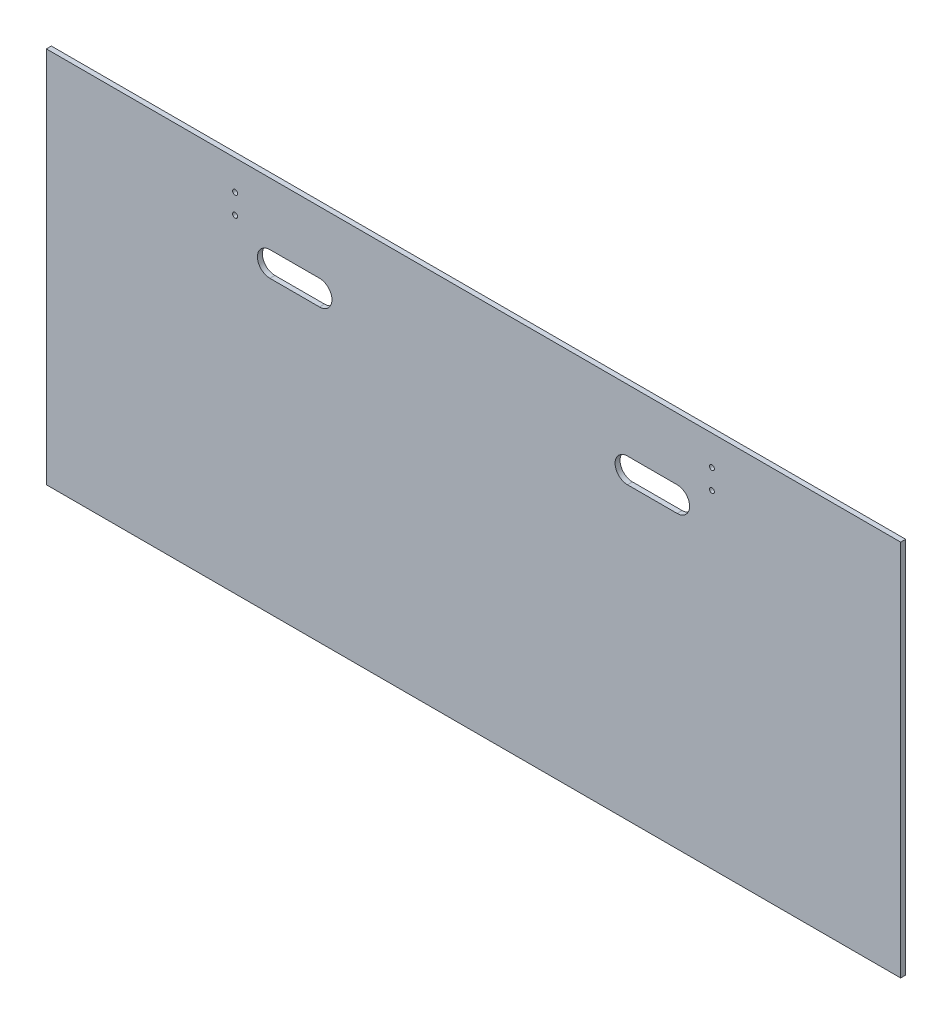
ISO-10303-21;
HEADER;
FILE_DESCRIPTION(('STEP AP214'),'2;1');
FILE_NAME('part.step','',(''),(''),'','','');
FILE_SCHEMA(('AUTOMOTIVE_DESIGN { 1 0 10303 214 1 1 1 1 }'));
ENDSEC;
DATA;
#1=APPLICATION_CONTEXT('core data for automotive mechanical design processes');
#2=APPLICATION_PROTOCOL_DEFINITION('international standard','automotive_design',2000,#1);
#3=PRODUCT_CONTEXT('',#1,'mechanical');
#4=PRODUCT('Part','Part','',(#3));
#5=PRODUCT_RELATED_PRODUCT_CATEGORY('part','',(#4));
#6=PRODUCT_DEFINITION_FORMATION('','',#4);
#7=PRODUCT_DEFINITION_CONTEXT('part definition',#1,'design');
#8=PRODUCT_DEFINITION('design','',#6,#7);
#9=PRODUCT_DEFINITION_SHAPE('','',#8);
#10=(LENGTH_UNIT() NAMED_UNIT(*) SI_UNIT(.MILLI.,.METRE.));
#11=(NAMED_UNIT(*) PLANE_ANGLE_UNIT() SI_UNIT($,.RADIAN.));
#12=(NAMED_UNIT(*) SI_UNIT($,.STERADIAN.) SOLID_ANGLE_UNIT());
#13=UNCERTAINTY_MEASURE_WITH_UNIT(LENGTH_MEASURE(1.E-05),#10,'distance_accuracy_value','');
#14=(GEOMETRIC_REPRESENTATION_CONTEXT(3) GLOBAL_UNCERTAINTY_ASSIGNED_CONTEXT((#13)) GLOBAL_UNIT_ASSIGNED_CONTEXT((#10,
#11,#12)) REPRESENTATION_CONTEXT('',''));
#15=CARTESIAN_POINT('',(0.,0.,0.));
#16=DIRECTION('',(0.,0.,1.));
#17=DIRECTION('',(1.,0.,0.));
#18=AXIS2_PLACEMENT_3D('',#15,#16,#17);
#19=CARTESIAN_POINT('',(0.,0.,6.35));
#20=DIRECTION('',(0.,0.,1.));
#21=DIRECTION('',(1.,0.,0.));
#22=AXIS2_PLACEMENT_3D('',#19,#20,#21);
#23=PLANE('',#22);
#24=DIRECTION('',(1.,0.,0.));
#25=VECTOR('',#24,1.);
#26=CARTESIAN_POINT('',(742.95,371.475,6.35));
#27=LINE('',#26,#25);
#28=CARTESIAN_POINT('',(806.45,371.475,6.35));
#29=VERTEX_POINT('',#28);
#30=CARTESIAN_POINT('',(742.95,371.475,6.35));
#31=VERTEX_POINT('',#30);
#32=EDGE_CURVE('E188',#29,#31,#27,.F.);
#33=ORIENTED_EDGE('',*,*,#32,.T.);
#34=CARTESIAN_POINT('',(742.95,387.35,6.35));
#35=DIRECTION('',(0.,0.,1.));
#36=DIRECTION('',(1.,0.,0.));
#37=AXIS2_PLACEMENT_3D('',#34,#35,#36);
#38=CIRCLE('',#37,15.875);
#39=CARTESIAN_POINT('',(742.95,403.225,6.35));
#40=VERTEX_POINT('',#39);
#41=EDGE_CURVE('E101',#31,#40,#38,.F.);
#42=ORIENTED_EDGE('',*,*,#41,.T.);
#43=DIRECTION('',(1.,0.,0.));
#44=VECTOR('',#43,1.);
#45=CARTESIAN_POINT('',(806.45,403.225,6.35));
#46=LINE('',#45,#44);
#47=CARTESIAN_POINT('',(806.45,403.225,6.35));
#48=VERTEX_POINT('',#47);
#49=EDGE_CURVE('E111',#40,#48,#46,.T.);
#50=ORIENTED_EDGE('',*,*,#49,.T.);
#51=CARTESIAN_POINT('',(806.45,387.35,6.35));
#52=DIRECTION('',(0.,0.,1.));
#53=DIRECTION('',(1.,0.,0.));
#54=AXIS2_PLACEMENT_3D('',#51,#52,#53);
#55=CIRCLE('',#54,15.875);
#56=EDGE_CURVE('E141',#48,#29,#55,.F.);
#57=ORIENTED_EDGE('',*,*,#56,.T.);
#58=EDGE_LOOP('',(#33,#42,#50,#57));
#59=FACE_BOUND('',#58,.T.);
#60=DIRECTION('',(1.,0.,0.));
#61=VECTOR('',#60,1.);
#62=CARTESIAN_POINT('',(285.75,371.475,6.35));
#63=LINE('',#62,#61);
#64=CARTESIAN_POINT('',(349.25,371.475,6.35));
#65=VERTEX_POINT('',#64);
#66=CARTESIAN_POINT('',(285.75,371.475,6.35));
#67=VERTEX_POINT('',#66);
#68=EDGE_CURVE('E97',#65,#67,#63,.F.);
#69=ORIENTED_EDGE('',*,*,#68,.T.);
#70=CARTESIAN_POINT('',(285.75,387.35,6.35));
#71=DIRECTION('',(0.,0.,1.));
#72=DIRECTION('',(1.,0.,0.));
#73=AXIS2_PLACEMENT_3D('',#70,#71,#72);
#74=CIRCLE('',#73,15.875);
#75=CARTESIAN_POINT('',(285.75,403.225,6.35));
#76=VERTEX_POINT('',#75);
#77=EDGE_CURVE('E82',#67,#76,#74,.F.);
#78=ORIENTED_EDGE('',*,*,#77,.T.);
#79=DIRECTION('',(1.,0.,0.));
#80=VECTOR('',#79,1.);
#81=CARTESIAN_POINT('',(349.25,403.225,6.35));
#82=LINE('',#81,#80);
#83=CARTESIAN_POINT('',(349.25,403.225,6.35));
#84=VERTEX_POINT('',#83);
#85=EDGE_CURVE('E113',#76,#84,#82,.T.);
#86=ORIENTED_EDGE('',*,*,#85,.T.);
#87=CARTESIAN_POINT('',(349.25,387.35,6.35));
#88=DIRECTION('',(0.,0.,1.));
#89=DIRECTION('',(1.,0.,0.));
#90=AXIS2_PLACEMENT_3D('',#87,#88,#89);
#91=CIRCLE('',#90,15.875);
#92=EDGE_CURVE('E105',#84,#65,#91,.F.);
#93=ORIENTED_EDGE('',*,*,#92,.T.);
#94=EDGE_LOOP('',(#69,#78,#86,#93));
#95=FACE_BOUND('',#94,.T.);
#96=CARTESIAN_POINT('',(850.9,419.1,6.35));
#97=DIRECTION('',(0.,0.,1.));
#98=DIRECTION('',(1.,0.,0.));
#99=AXIS2_PLACEMENT_3D('',#96,#97,#98);
#100=CIRCLE('',#99,3.175);
#101=CARTESIAN_POINT('',(854.075,419.1,6.35));
#102=VERTEX_POINT('',#101);
#103=EDGE_CURVE('E92',#102,#102,#100,.F.);
#104=ORIENTED_EDGE('',*,*,#103,.T.);
#105=EDGE_LOOP('',(#104));
#106=FACE_BOUND('',#105,.T.);
#107=CARTESIAN_POINT('',(850.9,444.5,6.35));
#108=DIRECTION('',(0.,0.,1.));
#109=DIRECTION('',(1.,0.,0.));
#110=AXIS2_PLACEMENT_3D('',#107,#108,#109);
#111=CIRCLE('',#110,3.175);
#112=CARTESIAN_POINT('',(854.075,444.5,6.35));
#113=VERTEX_POINT('',#112);
#114=EDGE_CURVE('E149',#113,#113,#111,.F.);
#115=ORIENTED_EDGE('',*,*,#114,.T.);
#116=EDGE_LOOP('',(#115));
#117=FACE_BOUND('',#116,.T.);
#118=CARTESIAN_POINT('',(241.3,419.1,6.35));
#119=DIRECTION('',(0.,0.,1.));
#120=DIRECTION('',(1.,0.,0.));
#121=AXIS2_PLACEMENT_3D('',#118,#119,#120);
#122=CIRCLE('',#121,3.175);
#123=CARTESIAN_POINT('',(244.475,419.1,6.35));
#124=VERTEX_POINT('',#123);
#125=EDGE_CURVE('E151',#124,#124,#122,.F.);
#126=ORIENTED_EDGE('',*,*,#125,.T.);
#127=EDGE_LOOP('',(#126));
#128=FACE_BOUND('',#127,.T.);
#129=CARTESIAN_POINT('',(241.3,444.5,6.35));
#130=DIRECTION('',(0.,0.,1.));
#131=DIRECTION('',(1.,0.,0.));
#132=AXIS2_PLACEMENT_3D('',#129,#130,#131);
#133=CIRCLE('',#132,3.175);
#134=CARTESIAN_POINT('',(244.475,444.5,6.35));
#135=VERTEX_POINT('',#134);
#136=EDGE_CURVE('E19',#135,#135,#133,.F.);
#137=ORIENTED_EDGE('',*,*,#136,.T.);
#138=EDGE_LOOP('',(#137));
#139=FACE_BOUND('',#138,.T.);
#140=DIRECTION('',(0.,1.,0.));
#141=VECTOR('',#140,1.);
#142=CARTESIAN_POINT('',(0.,482.6,6.35));
#143=LINE('',#142,#141);
#144=CARTESIAN_POINT('',(0.,0.,6.35));
#145=VERTEX_POINT('',#144);
#146=CARTESIAN_POINT('',(0.,482.6,6.35));
#147=VERTEX_POINT('',#146);
#148=EDGE_CURVE('E160',#145,#147,#143,.T.);
#149=ORIENTED_EDGE('',*,*,#148,.F.);
#150=DIRECTION('',(1.,0.,0.));
#151=VECTOR('',#150,1.);
#152=CARTESIAN_POINT('',(0.,0.,6.35));
#153=LINE('',#152,#151);
#154=CARTESIAN_POINT('',(1092.2,0.,6.35));
#155=VERTEX_POINT('',#154);
#156=EDGE_CURVE('E186',#155,#145,#153,.F.);
#157=ORIENTED_EDGE('',*,*,#156,.F.);
#158=DIRECTION('',(0.,1.,0.));
#159=VECTOR('',#158,1.);
#160=CARTESIAN_POINT('',(1092.2,0.,6.35));
#161=LINE('',#160,#159);
#162=CARTESIAN_POINT('',(1092.2,482.6,6.35));
#163=VERTEX_POINT('',#162);
#164=EDGE_CURVE('E183',#163,#155,#161,.F.);
#165=ORIENTED_EDGE('',*,*,#164,.F.);
#166=DIRECTION('',(1.,0.,0.));
#167=VECTOR('',#166,1.);
#168=CARTESIAN_POINT('',(1092.2,482.6,6.35));
#169=LINE('',#168,#167);
#170=EDGE_CURVE('E177',#147,#163,#169,.T.);
#171=ORIENTED_EDGE('',*,*,#170,.F.);
#172=EDGE_LOOP('',(#149,#157,#165,#171));
#173=FACE_BOUND('',#172,.T.);
#174=ADVANCED_FACE('F16',(#59,#95,#106,#117,#128,#139,#173),#23,.T.);
#175=CARTESIAN_POINT('',(0.,0.,0.));
#176=DIRECTION('',(0.,-1.,0.));
#177=DIRECTION('',(0.,0.,-1.));
#178=AXIS2_PLACEMENT_3D('',#175,#176,#177);
#179=PLANE('',#178);
#180=DIRECTION('',(0.,0.,1.));
#181=VECTOR('',#180,1.);
#182=CARTESIAN_POINT('',(0.,0.,0.));
#183=LINE('',#182,#181);
#184=CARTESIAN_POINT('',(0.,0.,0.));
#185=VERTEX_POINT('',#184);
#186=EDGE_CURVE('E167',#185,#145,#183,.T.);
#187=ORIENTED_EDGE('',*,*,#186,.F.);
#188=DIRECTION('',(1.,0.,0.));
#189=VECTOR('',#188,1.);
#190=CARTESIAN_POINT('',(0.,0.,0.));
#191=LINE('',#190,#189);
#192=CARTESIAN_POINT('',(1092.2,0.,0.));
#193=VERTEX_POINT('',#192);
#194=EDGE_CURVE('E193',#185,#193,#191,.T.);
#195=ORIENTED_EDGE('',*,*,#194,.T.);
#196=DIRECTION('',(0.,0.,-1.));
#197=VECTOR('',#196,1.);
#198=CARTESIAN_POINT('',(1092.2,0.,0.));
#199=LINE('',#198,#197);
#200=EDGE_CURVE('E180',#155,#193,#199,.T.);
#201=ORIENTED_EDGE('',*,*,#200,.F.);
#202=ORIENTED_EDGE('',*,*,#156,.T.);
#203=EDGE_LOOP('',(#187,#195,#201,#202));
#204=FACE_BOUND('',#203,.T.);
#205=ADVANCED_FACE('F234',(#204),#179,.T.);
#206=CARTESIAN_POINT('',(1092.2,0.,0.));
#207=DIRECTION('',(1.,0.,0.));
#208=DIRECTION('',(0.,0.,-1.));
#209=AXIS2_PLACEMENT_3D('',#206,#207,#208);
#210=PLANE('',#209);
#211=ORIENTED_EDGE('',*,*,#200,.T.);
#212=DIRECTION('',(0.,1.,0.));
#213=VECTOR('',#212,1.);
#214=CARTESIAN_POINT('',(1092.2,0.,0.));
#215=LINE('',#214,#213);
#216=CARTESIAN_POINT('',(1092.2,482.6,0.));
#217=VERTEX_POINT('',#216);
#218=EDGE_CURVE('E222',#193,#217,#215,.T.);
#219=ORIENTED_EDGE('',*,*,#218,.T.);
#220=DIRECTION('',(0.,0.,1.));
#221=VECTOR('',#220,1.);
#222=CARTESIAN_POINT('',(1092.2,482.6,0.));
#223=LINE('',#222,#221);
#224=EDGE_CURVE('E174',#163,#217,#223,.F.);
#225=ORIENTED_EDGE('',*,*,#224,.F.);
#226=ORIENTED_EDGE('',*,*,#164,.T.);
#227=EDGE_LOOP('',(#211,#219,#225,#226));
#228=FACE_BOUND('',#227,.T.);
#229=ADVANCED_FACE('F250',(#228),#210,.T.);
#230=CARTESIAN_POINT('',(1092.2,482.6,0.));
#231=DIRECTION('',(0.,1.,0.));
#232=DIRECTION('',(0.,0.,1.));
#233=AXIS2_PLACEMENT_3D('',#230,#231,#232);
#234=PLANE('',#233);
#235=ORIENTED_EDGE('',*,*,#224,.T.);
#236=DIRECTION('',(1.,0.,0.));
#237=VECTOR('',#236,1.);
#238=CARTESIAN_POINT('',(0.,482.6,0.));
#239=LINE('',#238,#237);
#240=CARTESIAN_POINT('',(0.,482.6,0.));
#241=VERTEX_POINT('',#240);
#242=EDGE_CURVE('E220',#217,#241,#239,.F.);
#243=ORIENTED_EDGE('',*,*,#242,.T.);
#244=DIRECTION('',(0.,0.,1.));
#245=VECTOR('',#244,1.);
#246=CARTESIAN_POINT('',(0.,482.6,0.));
#247=LINE('',#246,#245);
#248=EDGE_CURVE('E156',#147,#241,#247,.F.);
#249=ORIENTED_EDGE('',*,*,#248,.F.);
#250=ORIENTED_EDGE('',*,*,#170,.T.);
#251=EDGE_LOOP('',(#235,#243,#249,#250));
#252=FACE_BOUND('',#251,.T.);
#253=ADVANCED_FACE('F256',(#252),#234,.T.);
#254=CARTESIAN_POINT('',(0.,482.6,0.));
#255=DIRECTION('',(-1.,0.,0.));
#256=DIRECTION('',(0.,0.,1.));
#257=AXIS2_PLACEMENT_3D('',#254,#255,#256);
#258=PLANE('',#257);
#259=ORIENTED_EDGE('',*,*,#248,.T.);
#260=DIRECTION('',(0.,1.,0.));
#261=VECTOR('',#260,1.);
#262=CARTESIAN_POINT('',(0.,0.,0.));
#263=LINE('',#262,#261);
#264=EDGE_CURVE('E140',#241,#185,#263,.F.);
#265=ORIENTED_EDGE('',*,*,#264,.T.);
#266=ORIENTED_EDGE('',*,*,#186,.T.);
#267=ORIENTED_EDGE('',*,*,#148,.T.);
#268=EDGE_LOOP('',(#259,#265,#266,#267));
#269=FACE_BOUND('',#268,.T.);
#270=ADVANCED_FACE('F254',(#269),#258,.T.);
#271=CARTESIAN_POINT('',(241.3,444.5,0.));
#272=DIRECTION('',(0.,0.,1.));
#273=DIRECTION('',(1.,0.,0.));
#274=AXIS2_PLACEMENT_3D('',#271,#272,#273);
#275=CYLINDRICAL_SURFACE('',#274,3.175);
#276=ORIENTED_EDGE('',*,*,#136,.F.);
#277=EDGE_LOOP('',(#276));
#278=FACE_BOUND('',#277,.T.);
#279=CARTESIAN_POINT('',(241.3,444.5,0.));
#280=DIRECTION('',(0.,0.,1.));
#281=DIRECTION('',(1.,0.,0.));
#282=AXIS2_PLACEMENT_3D('',#279,#280,#281);
#283=CIRCLE('',#282,3.175);
#284=CARTESIAN_POINT('',(244.475,444.5,0.));
#285=VERTEX_POINT('',#284);
#286=EDGE_CURVE('E137',#285,#285,#283,.F.);
#287=ORIENTED_EDGE('',*,*,#286,.T.);
#288=EDGE_LOOP('',(#287));
#289=FACE_BOUND('',#288,.T.);
#290=ADVANCED_FACE('F264',(#278,#289),#275,.F.);
#291=CARTESIAN_POINT('',(241.3,419.1,0.));
#292=DIRECTION('',(0.,0.,1.));
#293=DIRECTION('',(1.,0.,0.));
#294=AXIS2_PLACEMENT_3D('',#291,#292,#293);
#295=CYLINDRICAL_SURFACE('',#294,3.175);
#296=ORIENTED_EDGE('',*,*,#125,.F.);
#297=EDGE_LOOP('',(#296));
#298=FACE_BOUND('',#297,.T.);
#299=CARTESIAN_POINT('',(241.3,419.1,0.));
#300=DIRECTION('',(0.,0.,1.));
#301=DIRECTION('',(1.,0.,0.));
#302=AXIS2_PLACEMENT_3D('',#299,#300,#301);
#303=CIRCLE('',#302,3.175);
#304=CARTESIAN_POINT('',(244.475,419.1,0.));
#305=VERTEX_POINT('',#304);
#306=EDGE_CURVE('E134',#305,#305,#303,.F.);
#307=ORIENTED_EDGE('',*,*,#306,.T.);
#308=EDGE_LOOP('',(#307));
#309=FACE_BOUND('',#308,.T.);
#310=ADVANCED_FACE('F303',(#298,#309),#295,.F.);
#311=CARTESIAN_POINT('',(850.9,444.5,0.));
#312=DIRECTION('',(0.,0.,1.));
#313=DIRECTION('',(1.,0.,0.));
#314=AXIS2_PLACEMENT_3D('',#311,#312,#313);
#315=CYLINDRICAL_SURFACE('',#314,3.175);
#316=ORIENTED_EDGE('',*,*,#114,.F.);
#317=EDGE_LOOP('',(#316));
#318=FACE_BOUND('',#317,.T.);
#319=CARTESIAN_POINT('',(850.9,444.5,0.));
#320=DIRECTION('',(0.,0.,1.));
#321=DIRECTION('',(1.,0.,0.));
#322=AXIS2_PLACEMENT_3D('',#319,#320,#321);
#323=CIRCLE('',#322,3.175);
#324=CARTESIAN_POINT('',(854.075,444.5,0.));
#325=VERTEX_POINT('',#324);
#326=EDGE_CURVE('E131',#325,#325,#323,.F.);
#327=ORIENTED_EDGE('',*,*,#326,.T.);
#328=EDGE_LOOP('',(#327));
#329=FACE_BOUND('',#328,.T.);
#330=ADVANCED_FACE('F299',(#318,#329),#315,.F.);
#331=CARTESIAN_POINT('',(850.9,419.1,0.));
#332=DIRECTION('',(0.,0.,1.));
#333=DIRECTION('',(1.,0.,0.));
#334=AXIS2_PLACEMENT_3D('',#331,#332,#333);
#335=CYLINDRICAL_SURFACE('',#334,3.175);
#336=ORIENTED_EDGE('',*,*,#103,.F.);
#337=EDGE_LOOP('',(#336));
#338=FACE_BOUND('',#337,.T.);
#339=CARTESIAN_POINT('',(850.9,419.1,0.));
#340=DIRECTION('',(0.,0.,1.));
#341=DIRECTION('',(1.,0.,0.));
#342=AXIS2_PLACEMENT_3D('',#339,#340,#341);
#343=CIRCLE('',#342,3.175);
#344=CARTESIAN_POINT('',(854.075,419.1,0.));
#345=VERTEX_POINT('',#344);
#346=EDGE_CURVE('E128',#345,#345,#343,.F.);
#347=ORIENTED_EDGE('',*,*,#346,.T.);
#348=EDGE_LOOP('',(#347));
#349=FACE_BOUND('',#348,.T.);
#350=ADVANCED_FACE('F296',(#338,#349),#335,.F.);
#351=CARTESIAN_POINT('',(285.75,387.35,0.));
#352=DIRECTION('',(0.,0.,1.));
#353=DIRECTION('',(1.,0.,0.));
#354=AXIS2_PLACEMENT_3D('',#351,#352,#353);
#355=CYLINDRICAL_SURFACE('',#354,15.875);
#356=ORIENTED_EDGE('',*,*,#77,.F.);
#357=DIRECTION('',(0.,0.,-1.));
#358=VECTOR('',#357,1.);
#359=CARTESIAN_POINT('',(285.75,371.475,0.));
#360=LINE('',#359,#358);
#361=CARTESIAN_POINT('',(285.75,371.475,0.));
#362=VERTEX_POINT('',#361);
#363=EDGE_CURVE('E86',#67,#362,#360,.T.);
#364=ORIENTED_EDGE('',*,*,#363,.T.);
#365=CARTESIAN_POINT('',(285.75,387.35,0.));
#366=DIRECTION('',(0.,0.,1.));
#367=DIRECTION('',(1.,0.,0.));
#368=AXIS2_PLACEMENT_3D('',#365,#366,#367);
#369=CIRCLE('',#368,15.875);
#370=CARTESIAN_POINT('',(285.75,403.225,0.));
#371=VERTEX_POINT('',#370);
#372=EDGE_CURVE('E126',#362,#371,#369,.F.);
#373=ORIENTED_EDGE('',*,*,#372,.T.);
#374=DIRECTION('',(0.,0.,1.));
#375=VECTOR('',#374,1.);
#376=CARTESIAN_POINT('',(285.75,403.225,0.));
#377=LINE('',#376,#375);
#378=EDGE_CURVE('E88',#371,#76,#377,.T.);
#379=ORIENTED_EDGE('',*,*,#378,.T.);
#380=EDGE_LOOP('',(#356,#364,#373,#379));
#381=FACE_BOUND('',#380,.T.);
#382=ADVANCED_FACE('F84',(#381),#355,.F.);
#383=CARTESIAN_POINT('',(349.25,403.225,0.));
#384=DIRECTION('',(0.,1.,0.));
#385=DIRECTION('',(0.,0.,1.));
#386=AXIS2_PLACEMENT_3D('',#383,#384,#385);
#387=PLANE('',#386);
#388=ORIENTED_EDGE('',*,*,#85,.F.);
#389=ORIENTED_EDGE('',*,*,#378,.F.);
#390=DIRECTION('',(1.,0.,0.));
#391=VECTOR('',#390,1.);
#392=CARTESIAN_POINT('',(0.,403.225,0.));
#393=LINE('',#392,#391);
#394=CARTESIAN_POINT('',(349.25,403.225,0.));
#395=VERTEX_POINT('',#394);
#396=EDGE_CURVE('E125',#371,#395,#393,.T.);
#397=ORIENTED_EDGE('',*,*,#396,.T.);
#398=DIRECTION('',(0.,0.,1.));
#399=VECTOR('',#398,1.);
#400=CARTESIAN_POINT('',(349.25,403.225,0.));
#401=LINE('',#400,#399);
#402=EDGE_CURVE('E115',#395,#84,#401,.T.);
#403=ORIENTED_EDGE('',*,*,#402,.T.);
#404=EDGE_LOOP('',(#388,#389,#397,#403));
#405=FACE_BOUND('',#404,.T.);
#406=ADVANCED_FACE('F207',(#405),#387,.F.);
#407=CARTESIAN_POINT('',(349.25,387.35,0.));
#408=DIRECTION('',(0.,0.,1.));
#409=DIRECTION('',(1.,0.,0.));
#410=AXIS2_PLACEMENT_3D('',#407,#408,#409);
#411=CYLINDRICAL_SURFACE('',#410,15.875);
#412=ORIENTED_EDGE('',*,*,#92,.F.);
#413=ORIENTED_EDGE('',*,*,#402,.F.);
#414=CARTESIAN_POINT('',(349.25,387.35,0.));
#415=DIRECTION('',(0.,0.,1.));
#416=DIRECTION('',(1.,0.,0.));
#417=AXIS2_PLACEMENT_3D('',#414,#415,#416);
#418=CIRCLE('',#417,15.875);
#419=CARTESIAN_POINT('',(349.25,371.475,0.));
#420=VERTEX_POINT('',#419);
#421=EDGE_CURVE('E122',#395,#420,#418,.F.);
#422=ORIENTED_EDGE('',*,*,#421,.T.);
#423=DIRECTION('',(0.,0.,-1.));
#424=VECTOR('',#423,1.);
#425=CARTESIAN_POINT('',(349.25,371.475,0.));
#426=LINE('',#425,#424);
#427=EDGE_CURVE('E106',#420,#65,#426,.F.);
#428=ORIENTED_EDGE('',*,*,#427,.T.);
#429=EDGE_LOOP('',(#412,#413,#422,#428));
#430=FACE_BOUND('',#429,.T.);
#431=ADVANCED_FACE('F211',(#430),#411,.F.);
#432=CARTESIAN_POINT('',(285.75,371.475,0.));
#433=DIRECTION('',(0.,-1.,0.));
#434=DIRECTION('',(0.,0.,-1.));
#435=AXIS2_PLACEMENT_3D('',#432,#433,#434);
#436=PLANE('',#435);
#437=ORIENTED_EDGE('',*,*,#68,.F.);
#438=ORIENTED_EDGE('',*,*,#427,.F.);
#439=DIRECTION('',(1.,0.,0.));
#440=VECTOR('',#439,1.);
#441=CARTESIAN_POINT('',(0.,371.475,0.));
#442=LINE('',#441,#440);
#443=EDGE_CURVE('E100',#420,#362,#442,.F.);
#444=ORIENTED_EDGE('',*,*,#443,.T.);
#445=ORIENTED_EDGE('',*,*,#363,.F.);
#446=EDGE_LOOP('',(#437,#438,#444,#445));
#447=FACE_BOUND('',#446,.T.);
#448=ADVANCED_FACE('F96',(#447),#436,.F.);
#449=CARTESIAN_POINT('',(742.95,387.35,0.));
#450=DIRECTION('',(0.,0.,1.));
#451=DIRECTION('',(1.,0.,0.));
#452=AXIS2_PLACEMENT_3D('',#449,#450,#451);
#453=CYLINDRICAL_SURFACE('',#452,15.875);
#454=ORIENTED_EDGE('',*,*,#41,.F.);
#455=DIRECTION('',(0.,0.,-1.));
#456=VECTOR('',#455,1.);
#457=CARTESIAN_POINT('',(742.95,371.475,0.));
#458=LINE('',#457,#456);
#459=CARTESIAN_POINT('',(742.95,371.475,0.));
#460=VERTEX_POINT('',#459);
#461=EDGE_CURVE('E190',#31,#460,#458,.T.);
#462=ORIENTED_EDGE('',*,*,#461,.T.);
#463=CARTESIAN_POINT('',(742.95,387.35,0.));
#464=DIRECTION('',(0.,0.,1.));
#465=DIRECTION('',(1.,0.,0.));
#466=AXIS2_PLACEMENT_3D('',#463,#464,#465);
#467=CIRCLE('',#466,15.875);
#468=CARTESIAN_POINT('',(742.95,403.225,0.));
#469=VERTEX_POINT('',#468);
#470=EDGE_CURVE('E119',#460,#469,#467,.F.);
#471=ORIENTED_EDGE('',*,*,#470,.T.);
#472=DIRECTION('',(0.,0.,1.));
#473=VECTOR('',#472,1.);
#474=CARTESIAN_POINT('',(742.95,403.225,0.));
#475=LINE('',#474,#473);
#476=EDGE_CURVE('E145',#469,#40,#475,.T.);
#477=ORIENTED_EDGE('',*,*,#476,.T.);
#478=EDGE_LOOP('',(#454,#462,#471,#477));
#479=FACE_BOUND('',#478,.T.);
#480=ADVANCED_FACE('F283',(#479),#453,.F.);
#481=CARTESIAN_POINT('',(806.45,403.225,0.));
#482=DIRECTION('',(0.,1.,0.));
#483=DIRECTION('',(0.,0.,1.));
#484=AXIS2_PLACEMENT_3D('',#481,#482,#483);
#485=PLANE('',#484);
#486=ORIENTED_EDGE('',*,*,#49,.F.);
#487=ORIENTED_EDGE('',*,*,#476,.F.);
#488=DIRECTION('',(1.,0.,0.));
#489=VECTOR('',#488,1.);
#490=CARTESIAN_POINT('',(0.,403.225,0.));
#491=LINE('',#490,#489);
#492=CARTESIAN_POINT('',(806.45,403.225,0.));
#493=VERTEX_POINT('',#492);
#494=EDGE_CURVE('E118',#469,#493,#491,.T.);
#495=ORIENTED_EDGE('',*,*,#494,.T.);
#496=DIRECTION('',(0.,0.,1.));
#497=VECTOR('',#496,1.);
#498=CARTESIAN_POINT('',(806.45,403.225,0.));
#499=LINE('',#498,#497);
#500=EDGE_CURVE('E143',#493,#48,#499,.T.);
#501=ORIENTED_EDGE('',*,*,#500,.T.);
#502=EDGE_LOOP('',(#486,#487,#495,#501));
#503=FACE_BOUND('',#502,.T.);
#504=ADVANCED_FACE('F280',(#503),#485,.F.);
#505=CARTESIAN_POINT('',(806.45,387.35,0.));
#506=DIRECTION('',(0.,0.,1.));
#507=DIRECTION('',(1.,0.,0.));
#508=AXIS2_PLACEMENT_3D('',#505,#506,#507);
#509=CYLINDRICAL_SURFACE('',#508,15.875);
#510=ORIENTED_EDGE('',*,*,#56,.F.);
#511=ORIENTED_EDGE('',*,*,#500,.F.);
#512=CARTESIAN_POINT('',(806.45,387.35,0.));
#513=DIRECTION('',(0.,0.,1.));
#514=DIRECTION('',(1.,0.,0.));
#515=AXIS2_PLACEMENT_3D('',#512,#513,#514);
#516=CIRCLE('',#515,15.875);
#517=CARTESIAN_POINT('',(806.45,371.475,0.));
#518=VERTEX_POINT('',#517);
#519=EDGE_CURVE('E25',#493,#518,#516,.F.);
#520=ORIENTED_EDGE('',*,*,#519,.T.);
#521=DIRECTION('',(0.,0.,-1.));
#522=VECTOR('',#521,1.);
#523=CARTESIAN_POINT('',(806.45,371.475,0.));
#524=LINE('',#523,#522);
#525=EDGE_CURVE('E33',#518,#29,#524,.F.);
#526=ORIENTED_EDGE('',*,*,#525,.T.);
#527=EDGE_LOOP('',(#510,#511,#520,#526));
#528=FACE_BOUND('',#527,.T.);
#529=ADVANCED_FACE('F274',(#528),#509,.F.);
#530=CARTESIAN_POINT('',(742.95,371.475,0.));
#531=DIRECTION('',(0.,-1.,0.));
#532=DIRECTION('',(0.,0.,-1.));
#533=AXIS2_PLACEMENT_3D('',#530,#531,#532);
#534=PLANE('',#533);
#535=ORIENTED_EDGE('',*,*,#32,.F.);
#536=ORIENTED_EDGE('',*,*,#525,.F.);
#537=DIRECTION('',(1.,0.,0.));
#538=VECTOR('',#537,1.);
#539=CARTESIAN_POINT('',(0.,371.475,0.));
#540=LINE('',#539,#538);
#541=EDGE_CURVE('E11',#518,#460,#540,.F.);
#542=ORIENTED_EDGE('',*,*,#541,.T.);
#543=ORIENTED_EDGE('',*,*,#461,.F.);
#544=EDGE_LOOP('',(#535,#536,#542,#543));
#545=FACE_BOUND('',#544,.T.);
#546=ADVANCED_FACE('F268',(#545),#534,.F.);
#547=CARTESIAN_POINT('',(0.,0.,0.));
#548=DIRECTION('',(0.,0.,1.));
#549=DIRECTION('',(1.,0.,0.));
#550=AXIS2_PLACEMENT_3D('',#547,#548,#549);
#551=PLANE('',#550);
#552=ORIENTED_EDGE('',*,*,#519,.F.);
#553=ORIENTED_EDGE('',*,*,#494,.F.);
#554=ORIENTED_EDGE('',*,*,#470,.F.);
#555=ORIENTED_EDGE('',*,*,#541,.F.);
#556=EDGE_LOOP('',(#552,#553,#554,#555));
#557=FACE_BOUND('',#556,.T.);
#558=ORIENTED_EDGE('',*,*,#421,.F.);
#559=ORIENTED_EDGE('',*,*,#396,.F.);
#560=ORIENTED_EDGE('',*,*,#372,.F.);
#561=ORIENTED_EDGE('',*,*,#443,.F.);
#562=EDGE_LOOP('',(#558,#559,#560,#561));
#563=FACE_BOUND('',#562,.T.);
#564=ORIENTED_EDGE('',*,*,#346,.F.);
#565=EDGE_LOOP('',(#564));
#566=FACE_BOUND('',#565,.T.);
#567=ORIENTED_EDGE('',*,*,#326,.F.);
#568=EDGE_LOOP('',(#567));
#569=FACE_BOUND('',#568,.T.);
#570=ORIENTED_EDGE('',*,*,#306,.F.);
#571=EDGE_LOOP('',(#570));
#572=FACE_BOUND('',#571,.T.);
#573=ORIENTED_EDGE('',*,*,#286,.F.);
#574=EDGE_LOOP('',(#573));
#575=FACE_BOUND('',#574,.T.);
#576=ORIENTED_EDGE('',*,*,#242,.F.);
#577=ORIENTED_EDGE('',*,*,#218,.F.);
#578=ORIENTED_EDGE('',*,*,#194,.F.);
#579=ORIENTED_EDGE('',*,*,#264,.F.);
#580=EDGE_LOOP('',(#576,#577,#578,#579));
#581=FACE_BOUND('',#580,.T.);
#582=ADVANCED_FACE('F213',(#557,#563,#566,#569,#572,#575,#581),#551,.F.);
#583=CLOSED_SHELL('',(#174,#205,#229,#253,#270,#290,#310,#330,#350,#382,#406,#431,#448,#480,
#504,#529,#546,#582));
#584=MANIFOLD_SOLID_BREP('B1',#583);
#585=ADVANCED_BREP_SHAPE_REPRESENTATION('',(#18,#584),#14);
#586=SHAPE_DEFINITION_REPRESENTATION(#9,#585);
ENDSEC;
END-ISO-10303-21;
